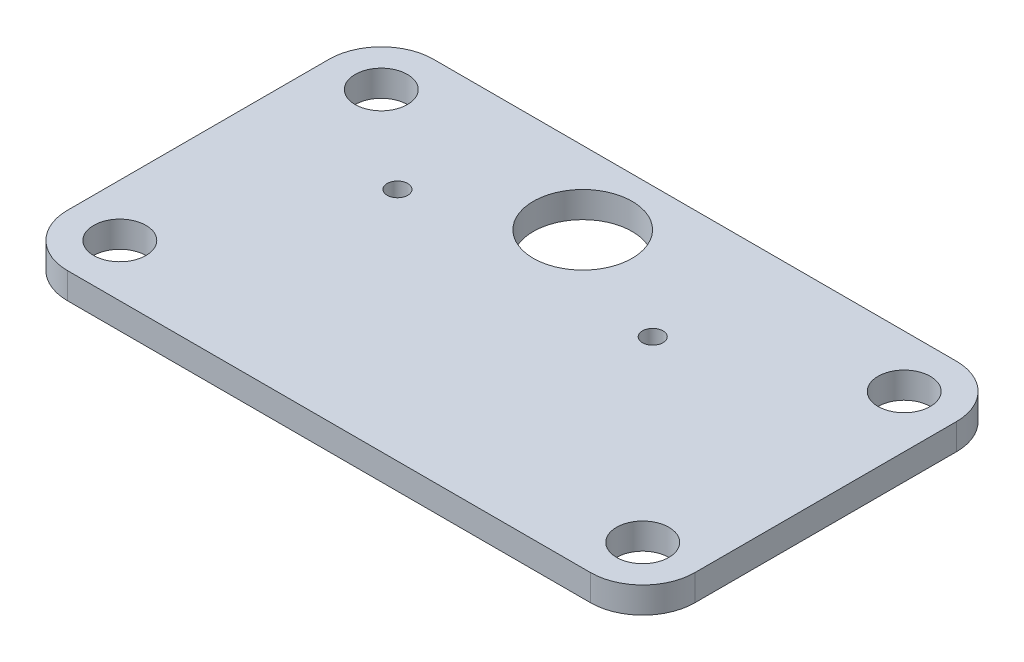
ISO-10303-21;
HEADER;
FILE_DESCRIPTION(('STEP AP214'),'2;1');
FILE_NAME('part.step','',(''),(''),'','','');
FILE_SCHEMA(('AUTOMOTIVE_DESIGN { 1 0 10303 214 1 1 1 1 }'));
ENDSEC;
DATA;
#1=APPLICATION_CONTEXT('core data for automotive mechanical design processes');
#2=APPLICATION_PROTOCOL_DEFINITION('international standard','automotive_design',2000,#1);
#3=PRODUCT_CONTEXT('',#1,'mechanical');
#4=PRODUCT('Part','Part','',(#3));
#5=PRODUCT_RELATED_PRODUCT_CATEGORY('part','',(#4));
#6=PRODUCT_DEFINITION_FORMATION('','',#4);
#7=PRODUCT_DEFINITION_CONTEXT('part definition',#1,'design');
#8=PRODUCT_DEFINITION('design','',#6,#7);
#9=PRODUCT_DEFINITION_SHAPE('','',#8);
#10=(LENGTH_UNIT() NAMED_UNIT(*) SI_UNIT(.MILLI.,.METRE.));
#11=(NAMED_UNIT(*) PLANE_ANGLE_UNIT() SI_UNIT($,.RADIAN.));
#12=(NAMED_UNIT(*) SI_UNIT($,.STERADIAN.) SOLID_ANGLE_UNIT());
#13=UNCERTAINTY_MEASURE_WITH_UNIT(LENGTH_MEASURE(1.E-05),#10,'distance_accuracy_value','');
#14=(GEOMETRIC_REPRESENTATION_CONTEXT(3) GLOBAL_UNCERTAINTY_ASSIGNED_CONTEXT((#13)) GLOBAL_UNIT_ASSIGNED_CONTEXT((#10,
#11,#12)) REPRESENTATION_CONTEXT('',''));
#15=CARTESIAN_POINT('',(0.,0.,0.));
#16=DIRECTION('',(0.,0.,1.));
#17=DIRECTION('',(1.,0.,0.));
#18=AXIS2_PLACEMENT_3D('',#15,#16,#17);
#19=CARTESIAN_POINT('',(36.5125,-3.175,-9.525));
#20=DIRECTION('',(0.,1.,0.));
#21=DIRECTION('',(0.,0.,1.));
#22=AXIS2_PLACEMENT_3D('',#19,#20,#21);
#23=CYLINDRICAL_SURFACE('',#22,6.35);
#24=CARTESIAN_POINT('',(36.5125,0.,-9.525));
#25=DIRECTION('',(0.,1.,0.));
#26=DIRECTION('',(0.,0.,1.));
#27=AXIS2_PLACEMENT_3D('',#24,#25,#26);
#28=CIRCLE('',#27,6.35);
#29=CARTESIAN_POINT('',(42.8625,0.,-9.525));
#30=VERTEX_POINT('',#29);
#31=CARTESIAN_POINT('',(36.5125,0.,-15.875));
#32=VERTEX_POINT('',#31);
#33=EDGE_CURVE('E135',#30,#32,#28,.T.);
#34=ORIENTED_EDGE('',*,*,#33,.F.);
#35=DIRECTION('',(0.,1.,0.));
#36=VECTOR('',#35,1.);
#37=CARTESIAN_POINT('',(42.8625,-3.175,-9.525));
#38=LINE('',#37,#36);
#39=CARTESIAN_POINT('',(42.8625,-3.175,-9.525));
#40=VERTEX_POINT('',#39);
#41=EDGE_CURVE('E11',#40,#30,#38,.T.);
#42=ORIENTED_EDGE('',*,*,#41,.F.);
#43=CARTESIAN_POINT('',(36.5125,-3.175,-9.525));
#44=DIRECTION('',(0.,1.,0.));
#45=DIRECTION('',(0.,0.,1.));
#46=AXIS2_PLACEMENT_3D('',#43,#44,#45);
#47=CIRCLE('',#46,6.35);
#48=CARTESIAN_POINT('',(36.5125,-3.175,-15.875));
#49=VERTEX_POINT('',#48);
#50=EDGE_CURVE('E156',#40,#49,#47,.T.);
#51=ORIENTED_EDGE('',*,*,#50,.T.);
#52=DIRECTION('',(0.,1.,0.));
#53=VECTOR('',#52,1.);
#54=CARTESIAN_POINT('',(36.5125,-3.175,-15.875));
#55=LINE('',#54,#53);
#56=EDGE_CURVE('E41',#49,#32,#55,.T.);
#57=ORIENTED_EDGE('',*,*,#56,.T.);
#58=EDGE_LOOP('',(#34,#42,#51,#57));
#59=FACE_BOUND('',#58,.T.);
#60=ADVANCED_FACE('F38',(#59),#23,.T.);
#61=CARTESIAN_POINT('',(42.8625,-3.175,22.225));
#62=DIRECTION('',(1.,0.,0.));
#63=DIRECTION('',(0.,0.,-1.));
#64=AXIS2_PLACEMENT_3D('',#61,#62,#63);
#65=PLANE('',#64);
#66=DIRECTION('',(0.,0.,-1.));
#67=VECTOR('',#66,1.);
#68=CARTESIAN_POINT('',(42.8625,0.,22.225));
#69=LINE('',#68,#67);
#70=CARTESIAN_POINT('',(42.8625,0.,22.225));
#71=VERTEX_POINT('',#70);
#72=EDGE_CURVE('E154',#71,#30,#69,.T.);
#73=ORIENTED_EDGE('',*,*,#72,.F.);
#74=DIRECTION('',(0.,1.,0.));
#75=VECTOR('',#74,1.);
#76=CARTESIAN_POINT('',(42.8625,-3.175,22.225));
#77=LINE('',#76,#75);
#78=CARTESIAN_POINT('',(42.8625,-3.175,22.225));
#79=VERTEX_POINT('',#78);
#80=EDGE_CURVE('E47',#79,#71,#77,.T.);
#81=ORIENTED_EDGE('',*,*,#80,.F.);
#82=DIRECTION('',(0.,0.,-1.));
#83=VECTOR('',#82,1.);
#84=CARTESIAN_POINT('',(42.8625,-3.175,22.225));
#85=LINE('',#84,#83);
#86=EDGE_CURVE('E125',#79,#40,#85,.T.);
#87=ORIENTED_EDGE('',*,*,#86,.T.);
#88=ORIENTED_EDGE('',*,*,#41,.T.);
#89=EDGE_LOOP('',(#73,#81,#87,#88));
#90=FACE_BOUND('',#89,.T.);
#91=ADVANCED_FACE('F168',(#90),#65,.T.);
#92=CARTESIAN_POINT('',(36.5125,-3.175,22.225));
#93=DIRECTION('',(0.,1.,0.));
#94=DIRECTION('',(0.,0.,1.));
#95=AXIS2_PLACEMENT_3D('',#92,#93,#94);
#96=CYLINDRICAL_SURFACE('',#95,6.35);
#97=CARTESIAN_POINT('',(36.5125,0.,22.225));
#98=DIRECTION('',(0.,1.,0.));
#99=DIRECTION('',(0.,0.,1.));
#100=AXIS2_PLACEMENT_3D('',#97,#98,#99);
#101=CIRCLE('',#100,6.35);
#102=CARTESIAN_POINT('',(36.5125,0.,28.575));
#103=VERTEX_POINT('',#102);
#104=EDGE_CURVE('E112',#103,#71,#101,.T.);
#105=ORIENTED_EDGE('',*,*,#104,.F.);
#106=DIRECTION('',(0.,1.,0.));
#107=VECTOR('',#106,1.);
#108=CARTESIAN_POINT('',(36.5125,-3.175,28.575));
#109=LINE('',#108,#107);
#110=CARTESIAN_POINT('',(36.5125,-3.175,28.575));
#111=VERTEX_POINT('',#110);
#112=EDGE_CURVE('E107',#111,#103,#109,.T.);
#113=ORIENTED_EDGE('',*,*,#112,.F.);
#114=CARTESIAN_POINT('',(36.5125,-3.175,22.225));
#115=DIRECTION('',(0.,1.,0.));
#116=DIRECTION('',(0.,0.,1.));
#117=AXIS2_PLACEMENT_3D('',#114,#115,#116);
#118=CIRCLE('',#117,6.35);
#119=EDGE_CURVE('E110',#111,#79,#118,.T.);
#120=ORIENTED_EDGE('',*,*,#119,.T.);
#121=ORIENTED_EDGE('',*,*,#80,.T.);
#122=EDGE_LOOP('',(#105,#113,#120,#121));
#123=FACE_BOUND('',#122,.T.);
#124=ADVANCED_FACE('F109',(#123),#96,.T.);
#125=CARTESIAN_POINT('',(36.5125,-3.175,28.575));
#126=DIRECTION('',(0.,0.,1.));
#127=DIRECTION('',(1.,0.,0.));
#128=AXIS2_PLACEMENT_3D('',#125,#126,#127);
#129=PLANE('',#128);
#130=DIRECTION('',(1.,0.,0.));
#131=VECTOR('',#130,1.);
#132=CARTESIAN_POINT('',(36.5125,0.,28.575));
#133=LINE('',#132,#131);
#134=CARTESIAN_POINT('',(-26.9875,0.,28.575));
#135=VERTEX_POINT('',#134);
#136=EDGE_CURVE('E151',#135,#103,#133,.T.);
#137=ORIENTED_EDGE('',*,*,#136,.F.);
#138=DIRECTION('',(0.,1.,0.));
#139=VECTOR('',#138,1.);
#140=CARTESIAN_POINT('',(-26.9875,-3.175,28.575));
#141=LINE('',#140,#139);
#142=CARTESIAN_POINT('',(-26.9875,-3.175,28.575));
#143=VERTEX_POINT('',#142);
#144=EDGE_CURVE('E117',#143,#135,#141,.T.);
#145=ORIENTED_EDGE('',*,*,#144,.F.);
#146=DIRECTION('',(1.,0.,0.));
#147=VECTOR('',#146,1.);
#148=CARTESIAN_POINT('',(36.5125,-3.175,28.575));
#149=LINE('',#148,#147);
#150=EDGE_CURVE('E123',#143,#111,#149,.T.);
#151=ORIENTED_EDGE('',*,*,#150,.T.);
#152=ORIENTED_EDGE('',*,*,#112,.T.);
#153=EDGE_LOOP('',(#137,#145,#151,#152));
#154=FACE_BOUND('',#153,.T.);
#155=ADVANCED_FACE('F127',(#154),#129,.T.);
#156=CARTESIAN_POINT('',(-26.9875,-3.175,22.225));
#157=DIRECTION('',(0.,1.,0.));
#158=DIRECTION('',(0.,0.,1.));
#159=AXIS2_PLACEMENT_3D('',#156,#157,#158);
#160=CYLINDRICAL_SURFACE('',#159,6.35);
#161=CARTESIAN_POINT('',(-26.9875,0.,22.225));
#162=DIRECTION('',(0.,1.,0.));
#163=DIRECTION('',(0.,0.,-1.));
#164=AXIS2_PLACEMENT_3D('',#161,#162,#163);
#165=CIRCLE('',#164,6.35);
#166=CARTESIAN_POINT('',(-33.3375,0.,22.225));
#167=VERTEX_POINT('',#166);
#168=EDGE_CURVE('E148',#167,#135,#165,.T.);
#169=ORIENTED_EDGE('',*,*,#168,.F.);
#170=DIRECTION('',(0.,1.,0.));
#171=VECTOR('',#170,1.);
#172=CARTESIAN_POINT('',(-33.3375,-3.175,22.225));
#173=LINE('',#172,#171);
#174=CARTESIAN_POINT('',(-33.3375,-3.175,22.225));
#175=VERTEX_POINT('',#174);
#176=EDGE_CURVE('E160',#175,#167,#173,.T.);
#177=ORIENTED_EDGE('',*,*,#176,.F.);
#178=CARTESIAN_POINT('',(-26.9875,-3.175,22.225));
#179=DIRECTION('',(0.,1.,0.));
#180=DIRECTION('',(0.,0.,-1.));
#181=AXIS2_PLACEMENT_3D('',#178,#179,#180);
#182=CIRCLE('',#181,6.35);
#183=EDGE_CURVE('E128',#175,#143,#182,.T.);
#184=ORIENTED_EDGE('',*,*,#183,.T.);
#185=ORIENTED_EDGE('',*,*,#144,.T.);
#186=EDGE_LOOP('',(#169,#177,#184,#185));
#187=FACE_BOUND('',#186,.T.);
#188=ADVANCED_FACE('F181',(#187),#160,.T.);
#189=CARTESIAN_POINT('',(-33.3375,-3.175,22.225));
#190=DIRECTION('',(-1.,0.,0.));
#191=DIRECTION('',(0.,0.,1.));
#192=AXIS2_PLACEMENT_3D('',#189,#190,#191);
#193=PLANE('',#192);
#194=DIRECTION('',(0.,0.,1.));
#195=VECTOR('',#194,1.);
#196=CARTESIAN_POINT('',(-33.3375,0.,22.225));
#197=LINE('',#196,#195);
#198=CARTESIAN_POINT('',(-33.3375,0.,-9.52499999999999));
#199=VERTEX_POINT('',#198);
#200=EDGE_CURVE('E145',#199,#167,#197,.T.);
#201=ORIENTED_EDGE('',*,*,#200,.F.);
#202=DIRECTION('',(0.,1.,0.));
#203=VECTOR('',#202,1.);
#204=CARTESIAN_POINT('',(-33.3375,-3.175,-9.52499999999999));
#205=LINE('',#204,#203);
#206=CARTESIAN_POINT('',(-33.3375,-3.175,-9.52499999999999));
#207=VERTEX_POINT('',#206);
#208=EDGE_CURVE('E162',#207,#199,#205,.T.);
#209=ORIENTED_EDGE('',*,*,#208,.F.);
#210=DIRECTION('',(0.,0.,1.));
#211=VECTOR('',#210,1.);
#212=CARTESIAN_POINT('',(-33.3375,-3.175,22.225));
#213=LINE('',#212,#211);
#214=EDGE_CURVE('E130',#207,#175,#213,.T.);
#215=ORIENTED_EDGE('',*,*,#214,.T.);
#216=ORIENTED_EDGE('',*,*,#176,.T.);
#217=EDGE_LOOP('',(#201,#209,#215,#216));
#218=FACE_BOUND('',#217,.T.);
#219=ADVANCED_FACE('F184',(#218),#193,.T.);
#220=CARTESIAN_POINT('',(-26.9875,-3.175,-9.52499999999999));
#221=DIRECTION('',(0.,1.,0.));
#222=DIRECTION('',(0.,0.,1.));
#223=AXIS2_PLACEMENT_3D('',#220,#221,#222);
#224=CYLINDRICAL_SURFACE('',#223,6.35);
#225=CARTESIAN_POINT('',(-26.9875,0.,-9.52499999999999));
#226=DIRECTION('',(0.,1.,0.));
#227=DIRECTION('',(0.,0.,1.));
#228=AXIS2_PLACEMENT_3D('',#225,#226,#227);
#229=CIRCLE('',#228,6.35);
#230=CARTESIAN_POINT('',(-26.9875,0.,-15.875));
#231=VERTEX_POINT('',#230);
#232=EDGE_CURVE('E142',#231,#199,#229,.T.);
#233=ORIENTED_EDGE('',*,*,#232,.F.);
#234=DIRECTION('',(0.,1.,0.));
#235=VECTOR('',#234,1.);
#236=CARTESIAN_POINT('',(-26.9875,-3.175,-15.875));
#237=LINE('',#236,#235);
#238=CARTESIAN_POINT('',(-26.9875,-3.175,-15.875));
#239=VERTEX_POINT('',#238);
#240=EDGE_CURVE('E163',#239,#231,#237,.T.);
#241=ORIENTED_EDGE('',*,*,#240,.F.);
#242=CARTESIAN_POINT('',(-26.9875,-3.175,-9.52499999999999));
#243=DIRECTION('',(0.,1.,0.));
#244=DIRECTION('',(0.,0.,1.));
#245=AXIS2_PLACEMENT_3D('',#242,#243,#244);
#246=CIRCLE('',#245,6.35);
#247=EDGE_CURVE('E281',#239,#207,#246,.T.);
#248=ORIENTED_EDGE('',*,*,#247,.T.);
#249=ORIENTED_EDGE('',*,*,#208,.T.);
#250=EDGE_LOOP('',(#233,#241,#248,#249));
#251=FACE_BOUND('',#250,.T.);
#252=ADVANCED_FACE('F188',(#251),#224,.T.);
#253=CARTESIAN_POINT('',(36.5125,-3.175,-15.875));
#254=DIRECTION('',(0.,0.,-1.));
#255=DIRECTION('',(-1.,0.,0.));
#256=AXIS2_PLACEMENT_3D('',#253,#254,#255);
#257=PLANE('',#256);
#258=DIRECTION('',(-1.,0.,0.));
#259=VECTOR('',#258,1.);
#260=CARTESIAN_POINT('',(36.5125,0.,-15.875));
#261=LINE('',#260,#259);
#262=EDGE_CURVE('E138',#32,#231,#261,.T.);
#263=ORIENTED_EDGE('',*,*,#262,.F.);
#264=ORIENTED_EDGE('',*,*,#56,.F.);
#265=DIRECTION('',(-1.,0.,0.));
#266=VECTOR('',#265,1.);
#267=CARTESIAN_POINT('',(36.5125,-3.175,-15.875));
#268=LINE('',#267,#266);
#269=EDGE_CURVE('E279',#49,#239,#268,.T.);
#270=ORIENTED_EDGE('',*,*,#269,.T.);
#271=ORIENTED_EDGE('',*,*,#240,.T.);
#272=EDGE_LOOP('',(#263,#264,#270,#271));
#273=FACE_BOUND('',#272,.T.);
#274=ADVANCED_FACE('F165',(#273),#257,.T.);
#275=CARTESIAN_POINT('',(36.5125,-3.175,-9.525));
#276=DIRECTION('',(0.,1.,0.));
#277=DIRECTION('',(0.,0.,1.));
#278=AXIS2_PLACEMENT_3D('',#275,#276,#277);
#279=PLANE('',#278);
#280=CARTESIAN_POINT('',(0.,-3.175,-6.99999999999997));
#281=DIRECTION('',(0.,1.,0.));
#282=DIRECTION('',(0.,0.,1.));
#283=AXIS2_PLACEMENT_3D('',#280,#281,#282);
#284=CIRCLE('',#283,6.);
#285=CARTESIAN_POINT('',(0.,-3.175,-0.99999999999997));
#286=VERTEX_POINT('',#285);
#287=EDGE_CURVE('E251',#286,#286,#284,.T.);
#288=ORIENTED_EDGE('',*,*,#287,.T.);
#289=EDGE_LOOP('',(#288));
#290=FACE_BOUND('',#289,.T.);
#291=CARTESIAN_POINT('',(-15.5,-3.175,0.));
#292=DIRECTION('',(0.,1.,0.));
#293=DIRECTION('',(0.,0.,1.));
#294=AXIS2_PLACEMENT_3D('',#291,#292,#293);
#295=CIRCLE('',#294,1.25);
#296=CARTESIAN_POINT('',(-15.5,-3.175,1.25000000000001));
#297=VERTEX_POINT('',#296);
#298=EDGE_CURVE('E236',#297,#297,#295,.T.);
#299=ORIENTED_EDGE('',*,*,#298,.T.);
#300=EDGE_LOOP('',(#299));
#301=FACE_BOUND('',#300,.T.);
#302=CARTESIAN_POINT('',(15.5,-3.175,0.));
#303=DIRECTION('',(0.,1.,0.));
#304=DIRECTION('',(0.,0.,1.));
#305=AXIS2_PLACEMENT_3D('',#302,#303,#304);
#306=CIRCLE('',#305,1.25);
#307=CARTESIAN_POINT('',(15.5,-3.175,1.25000000000004));
#308=VERTEX_POINT('',#307);
#309=EDGE_CURVE('E241',#308,#308,#306,.T.);
#310=ORIENTED_EDGE('',*,*,#309,.T.);
#311=EDGE_LOOP('',(#310));
#312=FACE_BOUND('',#311,.T.);
#313=CARTESIAN_POINT('',(36.5125,-3.175,22.225));
#314=DIRECTION('',(0.,1.,0.));
#315=DIRECTION('',(0.,0.,1.));
#316=AXIS2_PLACEMENT_3D('',#313,#314,#315);
#317=CIRCLE('',#316,3.175);
#318=CARTESIAN_POINT('',(36.5125,-3.175,25.4));
#319=VERTEX_POINT('',#318);
#320=EDGE_CURVE('E269',#319,#319,#317,.T.);
#321=ORIENTED_EDGE('',*,*,#320,.T.);
#322=EDGE_LOOP('',(#321));
#323=FACE_BOUND('',#322,.T.);
#324=CARTESIAN_POINT('',(36.5125,-3.175,-9.525));
#325=DIRECTION('',(0.,1.,0.));
#326=DIRECTION('',(0.,0.,1.));
#327=AXIS2_PLACEMENT_3D('',#324,#325,#326);
#328=CIRCLE('',#327,3.175);
#329=CARTESIAN_POINT('',(36.5125,-3.175,-6.35));
#330=VERTEX_POINT('',#329);
#331=EDGE_CURVE('E263',#330,#330,#328,.T.);
#332=ORIENTED_EDGE('',*,*,#331,.T.);
#333=EDGE_LOOP('',(#332));
#334=FACE_BOUND('',#333,.T.);
#335=CARTESIAN_POINT('',(-26.9875,-3.175,22.225));
#336=DIRECTION('',(0.,1.,0.));
#337=DIRECTION('',(0.,0.,1.));
#338=AXIS2_PLACEMENT_3D('',#335,#336,#337);
#339=CIRCLE('',#338,3.175);
#340=CARTESIAN_POINT('',(-26.9875,-3.175,25.4));
#341=VERTEX_POINT('',#340);
#342=EDGE_CURVE('E256',#341,#341,#339,.T.);
#343=ORIENTED_EDGE('',*,*,#342,.T.);
#344=EDGE_LOOP('',(#343));
#345=FACE_BOUND('',#344,.T.);
#346=CARTESIAN_POINT('',(-26.9875,-3.175,-9.52499999999999));
#347=DIRECTION('',(0.,1.,0.));
#348=DIRECTION('',(0.,0.,1.));
#349=AXIS2_PLACEMENT_3D('',#346,#347,#348);
#350=CIRCLE('',#349,3.175);
#351=CARTESIAN_POINT('',(-26.9875,-3.175,-6.35));
#352=VERTEX_POINT('',#351);
#353=EDGE_CURVE('E139',#352,#352,#350,.T.);
#354=ORIENTED_EDGE('',*,*,#353,.T.);
#355=EDGE_LOOP('',(#354));
#356=FACE_BOUND('',#355,.T.);
#357=ORIENTED_EDGE('',*,*,#50,.F.);
#358=ORIENTED_EDGE('',*,*,#86,.F.);
#359=ORIENTED_EDGE('',*,*,#119,.F.);
#360=ORIENTED_EDGE('',*,*,#150,.F.);
#361=ORIENTED_EDGE('',*,*,#183,.F.);
#362=ORIENTED_EDGE('',*,*,#214,.F.);
#363=ORIENTED_EDGE('',*,*,#247,.F.);
#364=ORIENTED_EDGE('',*,*,#269,.F.);
#365=EDGE_LOOP('',(#357,#358,#359,#360,#361,#362,#363,#364));
#366=FACE_BOUND('',#365,.T.);
#367=ADVANCED_FACE('F121',(#290,#301,#312,#323,#334,#345,#356,#366),#279,.F.);
#368=CARTESIAN_POINT('',(36.5125,0.,-9.525));
#369=DIRECTION('',(0.,1.,0.));
#370=DIRECTION('',(0.,0.,1.));
#371=AXIS2_PLACEMENT_3D('',#368,#369,#370);
#372=PLANE('',#371);
#373=CARTESIAN_POINT('',(0.,0.,-6.99999999999997));
#374=DIRECTION('',(0.,1.,0.));
#375=DIRECTION('',(0.,0.,1.));
#376=AXIS2_PLACEMENT_3D('',#373,#374,#375);
#377=CIRCLE('',#376,6.);
#378=CARTESIAN_POINT('',(0.,0.,-0.99999999999997));
#379=VERTEX_POINT('',#378);
#380=EDGE_CURVE('E243',#379,#379,#377,.T.);
#381=ORIENTED_EDGE('',*,*,#380,.F.);
#382=EDGE_LOOP('',(#381));
#383=FACE_BOUND('',#382,.T.);
#384=CARTESIAN_POINT('',(-15.5,0.,0.));
#385=DIRECTION('',(0.,1.,0.));
#386=DIRECTION('',(0.,0.,1.));
#387=AXIS2_PLACEMENT_3D('',#384,#385,#386);
#388=CIRCLE('',#387,1.25);
#389=CARTESIAN_POINT('',(-15.5,0.,1.25000000000001));
#390=VERTEX_POINT('',#389);
#391=EDGE_CURVE('E239',#390,#390,#388,.T.);
#392=ORIENTED_EDGE('',*,*,#391,.F.);
#393=EDGE_LOOP('',(#392));
#394=FACE_BOUND('',#393,.T.);
#395=CARTESIAN_POINT('',(15.5,0.,0.));
#396=DIRECTION('',(0.,1.,0.));
#397=DIRECTION('',(0.,0.,1.));
#398=AXIS2_PLACEMENT_3D('',#395,#396,#397);
#399=CIRCLE('',#398,1.25);
#400=CARTESIAN_POINT('',(15.5,0.,1.25000000000004));
#401=VERTEX_POINT('',#400);
#402=EDGE_CURVE('E246',#401,#401,#399,.T.);
#403=ORIENTED_EDGE('',*,*,#402,.F.);
#404=EDGE_LOOP('',(#403));
#405=FACE_BOUND('',#404,.T.);
#406=CARTESIAN_POINT('',(36.5125,0.,22.225));
#407=DIRECTION('',(0.,1.,0.));
#408=DIRECTION('',(0.,0.,1.));
#409=AXIS2_PLACEMENT_3D('',#406,#407,#408);
#410=CIRCLE('',#409,3.175);
#411=CARTESIAN_POINT('',(36.5125,0.,25.4));
#412=VERTEX_POINT('',#411);
#413=EDGE_CURVE('E253',#412,#412,#410,.T.);
#414=ORIENTED_EDGE('',*,*,#413,.F.);
#415=EDGE_LOOP('',(#414));
#416=FACE_BOUND('',#415,.T.);
#417=CARTESIAN_POINT('',(36.5125,0.,-9.525));
#418=DIRECTION('',(0.,1.,0.));
#419=DIRECTION('',(0.,0.,1.));
#420=AXIS2_PLACEMENT_3D('',#417,#418,#419);
#421=CIRCLE('',#420,3.175);
#422=CARTESIAN_POINT('',(36.5125,0.,-6.35));
#423=VERTEX_POINT('',#422);
#424=EDGE_CURVE('E266',#423,#423,#421,.T.);
#425=ORIENTED_EDGE('',*,*,#424,.F.);
#426=EDGE_LOOP('',(#425));
#427=FACE_BOUND('',#426,.T.);
#428=CARTESIAN_POINT('',(-26.9875,0.,22.225));
#429=DIRECTION('',(0.,1.,0.));
#430=DIRECTION('',(0.,0.,1.));
#431=AXIS2_PLACEMENT_3D('',#428,#429,#430);
#432=CIRCLE('',#431,3.175);
#433=CARTESIAN_POINT('',(-26.9875,0.,25.4));
#434=VERTEX_POINT('',#433);
#435=EDGE_CURVE('E260',#434,#434,#432,.T.);
#436=ORIENTED_EDGE('',*,*,#435,.F.);
#437=EDGE_LOOP('',(#436));
#438=FACE_BOUND('',#437,.T.);
#439=CARTESIAN_POINT('',(-26.9875,0.,-9.52499999999999));
#440=DIRECTION('',(0.,1.,0.));
#441=DIRECTION('',(0.,0.,1.));
#442=AXIS2_PLACEMENT_3D('',#439,#440,#441);
#443=CIRCLE('',#442,3.175);
#444=CARTESIAN_POINT('',(-26.9875,0.,-6.35));
#445=VERTEX_POINT('',#444);
#446=EDGE_CURVE('E259',#445,#445,#443,.T.);
#447=ORIENTED_EDGE('',*,*,#446,.F.);
#448=EDGE_LOOP('',(#447));
#449=FACE_BOUND('',#448,.T.);
#450=ORIENTED_EDGE('',*,*,#33,.T.);
#451=ORIENTED_EDGE('',*,*,#262,.T.);
#452=ORIENTED_EDGE('',*,*,#232,.T.);
#453=ORIENTED_EDGE('',*,*,#200,.T.);
#454=ORIENTED_EDGE('',*,*,#168,.T.);
#455=ORIENTED_EDGE('',*,*,#136,.T.);
#456=ORIENTED_EDGE('',*,*,#104,.T.);
#457=ORIENTED_EDGE('',*,*,#72,.T.);
#458=EDGE_LOOP('',(#450,#451,#452,#453,#454,#455,#456,#457));
#459=FACE_BOUND('',#458,.T.);
#460=ADVANCED_FACE('F167',(#383,#394,#405,#416,#427,#438,#449,#459),#372,.T.);
#461=CARTESIAN_POINT('',(-26.9875,-3.175,-9.52499999999999));
#462=DIRECTION('',(0.,1.,0.));
#463=DIRECTION('',(0.,0.,1.));
#464=AXIS2_PLACEMENT_3D('',#461,#462,#463);
#465=CYLINDRICAL_SURFACE('',#464,3.175);
#466=ORIENTED_EDGE('',*,*,#353,.F.);
#467=EDGE_LOOP('',(#466));
#468=FACE_BOUND('',#467,.T.);
#469=ORIENTED_EDGE('',*,*,#446,.T.);
#470=EDGE_LOOP('',(#469));
#471=FACE_BOUND('',#470,.T.);
#472=ADVANCED_FACE('F200',(#468,#471),#465,.F.);
#473=CARTESIAN_POINT('',(-26.9875,-3.175,22.225));
#474=DIRECTION('',(0.,1.,0.));
#475=DIRECTION('',(0.,0.,1.));
#476=AXIS2_PLACEMENT_3D('',#473,#474,#475);
#477=CYLINDRICAL_SURFACE('',#476,3.175);
#478=ORIENTED_EDGE('',*,*,#342,.F.);
#479=EDGE_LOOP('',(#478));
#480=FACE_BOUND('',#479,.T.);
#481=ORIENTED_EDGE('',*,*,#435,.T.);
#482=EDGE_LOOP('',(#481));
#483=FACE_BOUND('',#482,.T.);
#484=ADVANCED_FACE('F207',(#480,#483),#477,.F.);
#485=CARTESIAN_POINT('',(36.5125,-3.175,-9.525));
#486=DIRECTION('',(0.,1.,0.));
#487=DIRECTION('',(0.,0.,1.));
#488=AXIS2_PLACEMENT_3D('',#485,#486,#487);
#489=CYLINDRICAL_SURFACE('',#488,3.175);
#490=ORIENTED_EDGE('',*,*,#331,.F.);
#491=EDGE_LOOP('',(#490));
#492=FACE_BOUND('',#491,.T.);
#493=ORIENTED_EDGE('',*,*,#424,.T.);
#494=EDGE_LOOP('',(#493));
#495=FACE_BOUND('',#494,.T.);
#496=ADVANCED_FACE('F213',(#492,#495),#489,.F.);
#497=CARTESIAN_POINT('',(36.5125,-3.175,22.225));
#498=DIRECTION('',(0.,1.,0.));
#499=DIRECTION('',(0.,0.,1.));
#500=AXIS2_PLACEMENT_3D('',#497,#498,#499);
#501=CYLINDRICAL_SURFACE('',#500,3.175);
#502=ORIENTED_EDGE('',*,*,#320,.F.);
#503=EDGE_LOOP('',(#502));
#504=FACE_BOUND('',#503,.T.);
#505=ORIENTED_EDGE('',*,*,#413,.T.);
#506=EDGE_LOOP('',(#505));
#507=FACE_BOUND('',#506,.T.);
#508=ADVANCED_FACE('F209',(#504,#507),#501,.F.);
#509=CARTESIAN_POINT('',(15.5,-3.175,0.));
#510=DIRECTION('',(0.,1.,0.));
#511=DIRECTION('',(0.,0.,1.));
#512=AXIS2_PLACEMENT_3D('',#509,#510,#511);
#513=CYLINDRICAL_SURFACE('',#512,1.25);
#514=ORIENTED_EDGE('',*,*,#309,.F.);
#515=EDGE_LOOP('',(#514));
#516=FACE_BOUND('',#515,.T.);
#517=ORIENTED_EDGE('',*,*,#402,.T.);
#518=EDGE_LOOP('',(#517));
#519=FACE_BOUND('',#518,.T.);
#520=ADVANCED_FACE('F212',(#516,#519),#513,.F.);
#521=CARTESIAN_POINT('',(-15.5,-3.175,0.));
#522=DIRECTION('',(0.,1.,0.));
#523=DIRECTION('',(0.,0.,1.));
#524=AXIS2_PLACEMENT_3D('',#521,#522,#523);
#525=CYLINDRICAL_SURFACE('',#524,1.25);
#526=ORIENTED_EDGE('',*,*,#298,.F.);
#527=EDGE_LOOP('',(#526));
#528=FACE_BOUND('',#527,.T.);
#529=ORIENTED_EDGE('',*,*,#391,.T.);
#530=EDGE_LOOP('',(#529));
#531=FACE_BOUND('',#530,.T.);
#532=ADVANCED_FACE('F224',(#528,#531),#525,.F.);
#533=CARTESIAN_POINT('',(0.,-3.175,-6.99999999999997));
#534=DIRECTION('',(0.,1.,0.));
#535=DIRECTION('',(0.,0.,1.));
#536=AXIS2_PLACEMENT_3D('',#533,#534,#535);
#537=CYLINDRICAL_SURFACE('',#536,6.);
#538=ORIENTED_EDGE('',*,*,#287,.F.);
#539=EDGE_LOOP('',(#538));
#540=FACE_BOUND('',#539,.T.);
#541=ORIENTED_EDGE('',*,*,#380,.T.);
#542=EDGE_LOOP('',(#541));
#543=FACE_BOUND('',#542,.T.);
#544=ADVANCED_FACE('F221',(#540,#543),#537,.F.);
#545=CLOSED_SHELL('',(#60,#91,#124,#155,#188,#219,#252,#274,#367,#460,#472,#484,#496,#508,#520,
#532,#544));
#546=MANIFOLD_SOLID_BREP('B2',#545);
#547=ADVANCED_BREP_SHAPE_REPRESENTATION('',(#18,#546),#14);
#548=SHAPE_DEFINITION_REPRESENTATION(#9,#547);
ENDSEC;
END-ISO-10303-21;
